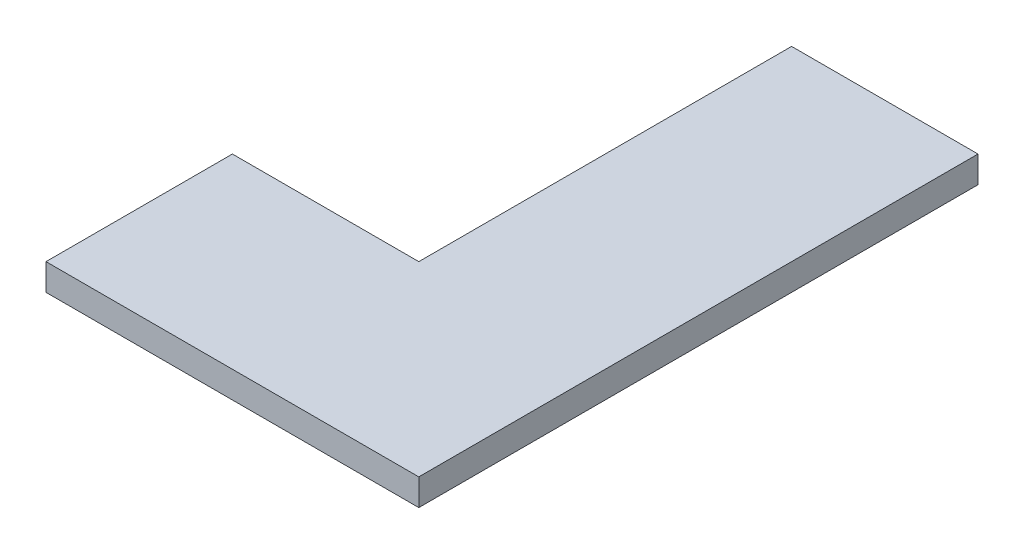
ISO-10303-21;
HEADER;
FILE_DESCRIPTION(('STEP AP214'),'2;1');
FILE_NAME('part.step','',(''),(''),'','','');
FILE_SCHEMA(('AUTOMOTIVE_DESIGN { 1 0 10303 214 1 1 1 1 }'));
ENDSEC;
DATA;
#1=APPLICATION_CONTEXT('core data for automotive mechanical design processes');
#2=APPLICATION_PROTOCOL_DEFINITION('international standard','automotive_design',2000,#1);
#3=PRODUCT_CONTEXT('',#1,'mechanical');
#4=PRODUCT('Part','Part','',(#3));
#5=PRODUCT_RELATED_PRODUCT_CATEGORY('part','',(#4));
#6=PRODUCT_DEFINITION_FORMATION('','',#4);
#7=PRODUCT_DEFINITION_CONTEXT('part definition',#1,'design');
#8=PRODUCT_DEFINITION('design','',#6,#7);
#9=PRODUCT_DEFINITION_SHAPE('','',#8);
#10=(LENGTH_UNIT() NAMED_UNIT(*) SI_UNIT(.MILLI.,.METRE.));
#11=(NAMED_UNIT(*) PLANE_ANGLE_UNIT() SI_UNIT($,.RADIAN.));
#12=(NAMED_UNIT(*) SI_UNIT($,.STERADIAN.) SOLID_ANGLE_UNIT());
#13=UNCERTAINTY_MEASURE_WITH_UNIT(LENGTH_MEASURE(1.E-05),#10,'distance_accuracy_value','');
#14=(GEOMETRIC_REPRESENTATION_CONTEXT(3) GLOBAL_UNCERTAINTY_ASSIGNED_CONTEXT((#13)) GLOBAL_UNIT_ASSIGNED_CONTEXT((#10,
#11,#12)) REPRESENTATION_CONTEXT('',''));
#15=CARTESIAN_POINT('',(0.,0.,0.));
#16=DIRECTION('',(0.,0.,1.));
#17=DIRECTION('',(1.,0.,0.));
#18=AXIS2_PLACEMENT_3D('',#15,#16,#17);
#19=CARTESIAN_POINT('',(70.,10.,105.));
#20=DIRECTION('',(0.,0.,-1.));
#21=DIRECTION('',(-1.,0.,0.));
#22=AXIS2_PLACEMENT_3D('',#19,#20,#21);
#23=PLANE('',#22);
#24=DIRECTION('',(1.,0.,0.));
#25=VECTOR('',#24,1.);
#26=CARTESIAN_POINT('',(70.,0.,105.));
#27=LINE('',#26,#25);
#28=CARTESIAN_POINT('',(-70.,0.,105.));
#29=VERTEX_POINT('',#28);
#30=CARTESIAN_POINT('',(70.,0.,105.));
#31=VERTEX_POINT('',#30);
#32=EDGE_CURVE('E118',#29,#31,#27,.T.);
#33=ORIENTED_EDGE('',*,*,#32,.T.);
#34=DIRECTION('',(0.,-1.,0.));
#35=VECTOR('',#34,1.);
#36=CARTESIAN_POINT('',(70.,10.,105.));
#37=LINE('',#36,#35);
#38=CARTESIAN_POINT('',(70.,10.,105.));
#39=VERTEX_POINT('',#38);
#40=EDGE_CURVE('E11',#39,#31,#37,.T.);
#41=ORIENTED_EDGE('',*,*,#40,.F.);
#42=DIRECTION('',(1.,0.,0.));
#43=VECTOR('',#42,1.);
#44=CARTESIAN_POINT('',(70.,10.,105.));
#45=LINE('',#44,#43);
#46=CARTESIAN_POINT('',(-70.,10.,105.));
#47=VERTEX_POINT('',#46);
#48=EDGE_CURVE('E128',#47,#39,#45,.T.);
#49=ORIENTED_EDGE('',*,*,#48,.F.);
#50=DIRECTION('',(0.,-1.,0.));
#51=VECTOR('',#50,1.);
#52=CARTESIAN_POINT('',(-70.,10.,105.));
#53=LINE('',#52,#51);
#54=EDGE_CURVE('E114',#47,#29,#53,.T.);
#55=ORIENTED_EDGE('',*,*,#54,.T.);
#56=EDGE_LOOP('',(#33,#41,#49,#55));
#57=FACE_BOUND('',#56,.T.);
#58=ADVANCED_FACE('F34',(#57),#23,.F.);
#59=CARTESIAN_POINT('',(70.,10.,-105.));
#60=DIRECTION('',(-1.,0.,0.));
#61=DIRECTION('',(0.,0.,1.));
#62=AXIS2_PLACEMENT_3D('',#59,#60,#61);
#63=PLANE('',#62);
#64=DIRECTION('',(0.,0.,-1.));
#65=VECTOR('',#64,1.);
#66=CARTESIAN_POINT('',(70.,0.,-105.));
#67=LINE('',#66,#65);
#68=CARTESIAN_POINT('',(70.,0.,-105.));
#69=VERTEX_POINT('',#68);
#70=EDGE_CURVE('E121',#31,#69,#67,.T.);
#71=ORIENTED_EDGE('',*,*,#70,.T.);
#72=DIRECTION('',(0.,-1.,0.));
#73=VECTOR('',#72,1.);
#74=CARTESIAN_POINT('',(70.,10.,-105.));
#75=LINE('',#74,#73);
#76=CARTESIAN_POINT('',(70.,10.,-105.));
#77=VERTEX_POINT('',#76);
#78=EDGE_CURVE('E42',#77,#69,#75,.T.);
#79=ORIENTED_EDGE('',*,*,#78,.F.);
#80=DIRECTION('',(0.,0.,-1.));
#81=VECTOR('',#80,1.);
#82=CARTESIAN_POINT('',(70.,10.,-105.));
#83=LINE('',#82,#81);
#84=EDGE_CURVE('E87',#39,#77,#83,.T.);
#85=ORIENTED_EDGE('',*,*,#84,.F.);
#86=ORIENTED_EDGE('',*,*,#40,.T.);
#87=EDGE_LOOP('',(#71,#79,#85,#86));
#88=FACE_BOUND('',#87,.T.);
#89=ADVANCED_FACE('F152',(#88),#63,.F.);
#90=CARTESIAN_POINT('',(0.,10.,-105.));
#91=DIRECTION('',(0.,0.,1.));
#92=DIRECTION('',(1.,0.,0.));
#93=AXIS2_PLACEMENT_3D('',#90,#91,#92);
#94=PLANE('',#93);
#95=DIRECTION('',(-1.,0.,0.));
#96=VECTOR('',#95,1.);
#97=CARTESIAN_POINT('',(0.,0.,-105.));
#98=LINE('',#97,#96);
#99=CARTESIAN_POINT('',(0.,0.,-105.));
#100=VERTEX_POINT('',#99);
#101=EDGE_CURVE('E123',#69,#100,#98,.T.);
#102=ORIENTED_EDGE('',*,*,#101,.T.);
#103=DIRECTION('',(0.,-1.,0.));
#104=VECTOR('',#103,1.);
#105=CARTESIAN_POINT('',(0.,10.,-105.));
#106=LINE('',#105,#104);
#107=CARTESIAN_POINT('',(0.,10.,-105.));
#108=VERTEX_POINT('',#107);
#109=EDGE_CURVE('E109',#108,#100,#106,.T.);
#110=ORIENTED_EDGE('',*,*,#109,.F.);
#111=DIRECTION('',(-1.,0.,0.));
#112=VECTOR('',#111,1.);
#113=CARTESIAN_POINT('',(0.,10.,-105.));
#114=LINE('',#113,#112);
#115=EDGE_CURVE('E100',#77,#108,#114,.T.);
#116=ORIENTED_EDGE('',*,*,#115,.F.);
#117=ORIENTED_EDGE('',*,*,#78,.T.);
#118=EDGE_LOOP('',(#102,#110,#116,#117));
#119=FACE_BOUND('',#118,.T.);
#120=ADVANCED_FACE('F134',(#119),#94,.F.);
#121=CARTESIAN_POINT('',(0.,10.,35.));
#122=DIRECTION('',(1.,0.,0.));
#123=DIRECTION('',(0.,0.,-1.));
#124=AXIS2_PLACEMENT_3D('',#121,#122,#123);
#125=PLANE('',#124);
#126=DIRECTION('',(0.,0.,1.));
#127=VECTOR('',#126,1.);
#128=CARTESIAN_POINT('',(0.,0.,35.));
#129=LINE('',#128,#127);
#130=CARTESIAN_POINT('',(0.,0.,35.));
#131=VERTEX_POINT('',#130);
#132=EDGE_CURVE('E108',#100,#131,#129,.T.);
#133=ORIENTED_EDGE('',*,*,#132,.T.);
#134=DIRECTION('',(0.,-1.,0.));
#135=VECTOR('',#134,1.);
#136=CARTESIAN_POINT('',(0.,10.,35.));
#137=LINE('',#136,#135);
#138=CARTESIAN_POINT('',(0.,10.,35.));
#139=VERTEX_POINT('',#138);
#140=EDGE_CURVE('E105',#139,#131,#137,.T.);
#141=ORIENTED_EDGE('',*,*,#140,.F.);
#142=DIRECTION('',(0.,0.,1.));
#143=VECTOR('',#142,1.);
#144=CARTESIAN_POINT('',(0.,10.,35.));
#145=LINE('',#144,#143);
#146=EDGE_CURVE('E94',#108,#139,#145,.T.);
#147=ORIENTED_EDGE('',*,*,#146,.F.);
#148=ORIENTED_EDGE('',*,*,#109,.T.);
#149=EDGE_LOOP('',(#133,#141,#147,#148));
#150=FACE_BOUND('',#149,.T.);
#151=ADVANCED_FACE('F106',(#150),#125,.F.);
#152=CARTESIAN_POINT('',(-70.,10.,35.));
#153=DIRECTION('',(0.,0.,1.));
#154=DIRECTION('',(1.,0.,0.));
#155=AXIS2_PLACEMENT_3D('',#152,#153,#154);
#156=PLANE('',#155);
#157=DIRECTION('',(-1.,0.,0.));
#158=VECTOR('',#157,1.);
#159=CARTESIAN_POINT('',(-70.,0.,35.));
#160=LINE('',#159,#158);
#161=CARTESIAN_POINT('',(-70.,0.,35.));
#162=VERTEX_POINT('',#161);
#163=EDGE_CURVE('E73',#131,#162,#160,.T.);
#164=ORIENTED_EDGE('',*,*,#163,.T.);
#165=DIRECTION('',(0.,-1.,0.));
#166=VECTOR('',#165,1.);
#167=CARTESIAN_POINT('',(-70.,10.,35.));
#168=LINE('',#167,#166);
#169=CARTESIAN_POINT('',(-70.,10.,35.));
#170=VERTEX_POINT('',#169);
#171=EDGE_CURVE('E110',#170,#162,#168,.T.);
#172=ORIENTED_EDGE('',*,*,#171,.F.);
#173=DIRECTION('',(-1.,0.,0.));
#174=VECTOR('',#173,1.);
#175=CARTESIAN_POINT('',(-70.,10.,35.));
#176=LINE('',#175,#174);
#177=EDGE_CURVE('E98',#139,#170,#176,.T.);
#178=ORIENTED_EDGE('',*,*,#177,.F.);
#179=ORIENTED_EDGE('',*,*,#140,.T.);
#180=EDGE_LOOP('',(#164,#172,#178,#179));
#181=FACE_BOUND('',#180,.T.);
#182=ADVANCED_FACE('F112',(#181),#156,.F.);
#183=CARTESIAN_POINT('',(-70.,10.,105.));
#184=DIRECTION('',(1.,0.,0.));
#185=DIRECTION('',(0.,0.,-1.));
#186=AXIS2_PLACEMENT_3D('',#183,#184,#185);
#187=PLANE('',#186);
#188=DIRECTION('',(0.,0.,1.));
#189=VECTOR('',#188,1.);
#190=CARTESIAN_POINT('',(-70.,0.,105.));
#191=LINE('',#190,#189);
#192=EDGE_CURVE('E79',#162,#29,#191,.T.);
#193=ORIENTED_EDGE('',*,*,#192,.T.);
#194=ORIENTED_EDGE('',*,*,#54,.F.);
#195=DIRECTION('',(0.,0.,1.));
#196=VECTOR('',#195,1.);
#197=CARTESIAN_POINT('',(-70.,10.,105.));
#198=LINE('',#197,#196);
#199=EDGE_CURVE('E50',#170,#47,#198,.T.);
#200=ORIENTED_EDGE('',*,*,#199,.F.);
#201=ORIENTED_EDGE('',*,*,#171,.T.);
#202=EDGE_LOOP('',(#193,#194,#200,#201));
#203=FACE_BOUND('',#202,.T.);
#204=ADVANCED_FACE('F141',(#203),#187,.F.);
#205=CARTESIAN_POINT('',(0.,10.,0.));
#206=DIRECTION('',(0.,-1.,0.));
#207=DIRECTION('',(0.,0.,-1.));
#208=AXIS2_PLACEMENT_3D('',#205,#206,#207);
#209=PLANE('',#208);
#210=ORIENTED_EDGE('',*,*,#48,.T.);
#211=ORIENTED_EDGE('',*,*,#84,.T.);
#212=ORIENTED_EDGE('',*,*,#115,.T.);
#213=ORIENTED_EDGE('',*,*,#146,.T.);
#214=ORIENTED_EDGE('',*,*,#177,.T.);
#215=ORIENTED_EDGE('',*,*,#199,.T.);
#216=EDGE_LOOP('',(#210,#211,#212,#213,#214,#215));
#217=FACE_BOUND('',#216,.T.);
#218=ADVANCED_FACE('F96',(#217),#209,.F.);
#219=CARTESIAN_POINT('',(0.,0.,0.));
#220=DIRECTION('',(0.,-1.,0.));
#221=DIRECTION('',(0.,0.,-1.));
#222=AXIS2_PLACEMENT_3D('',#219,#220,#221);
#223=PLANE('',#222);
#224=ORIENTED_EDGE('',*,*,#32,.F.);
#225=ORIENTED_EDGE('',*,*,#192,.F.);
#226=ORIENTED_EDGE('',*,*,#163,.F.);
#227=ORIENTED_EDGE('',*,*,#132,.F.);
#228=ORIENTED_EDGE('',*,*,#101,.F.);
#229=ORIENTED_EDGE('',*,*,#70,.F.);
#230=EDGE_LOOP('',(#224,#225,#226,#227,#228,#229));
#231=FACE_BOUND('',#230,.T.);
#232=ADVANCED_FACE('F137',(#231),#223,.T.);
#233=CLOSED_SHELL('',(#58,#89,#120,#151,#182,#204,#218,#232));
#234=MANIFOLD_SOLID_BREP('B2',#233);
#235=ADVANCED_BREP_SHAPE_REPRESENTATION('',(#18,#234),#14);
#236=SHAPE_DEFINITION_REPRESENTATION(#9,#235);
ENDSEC;
END-ISO-10303-21;
